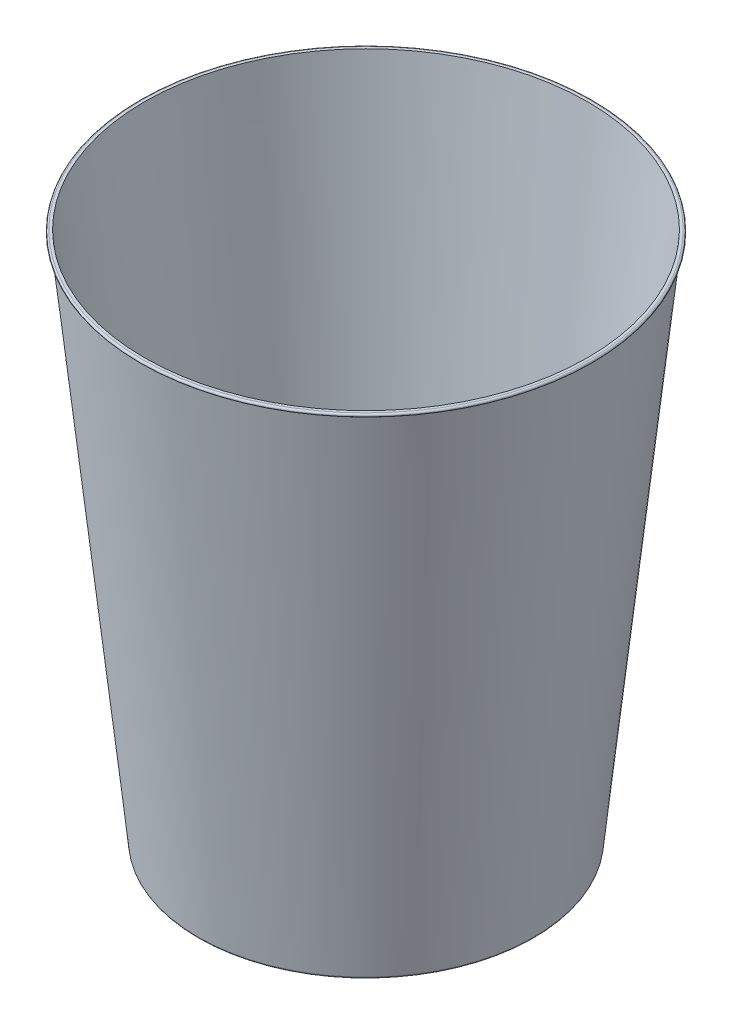
ISO-10303-21;
HEADER;
FILE_DESCRIPTION(('STEP AP214'),'2;1');
FILE_NAME('part.step','',(''),(''),'','','');
FILE_SCHEMA(('AUTOMOTIVE_DESIGN { 1 0 10303 214 1 1 1 1 }'));
ENDSEC;
DATA;
#1=APPLICATION_CONTEXT('core data for automotive mechanical design processes');
#2=APPLICATION_PROTOCOL_DEFINITION('international standard','automotive_design',2000,#1);
#3=PRODUCT_CONTEXT('',#1,'mechanical');
#4=PRODUCT('Part','Part','',(#3));
#5=PRODUCT_RELATED_PRODUCT_CATEGORY('part','',(#4));
#6=PRODUCT_DEFINITION_FORMATION('','',#4);
#7=PRODUCT_DEFINITION_CONTEXT('part definition',#1,'design');
#8=PRODUCT_DEFINITION('design','',#6,#7);
#9=PRODUCT_DEFINITION_SHAPE('','',#8);
#10=(LENGTH_UNIT() NAMED_UNIT(*) SI_UNIT(.MILLI.,.METRE.));
#11=(NAMED_UNIT(*) PLANE_ANGLE_UNIT() SI_UNIT($,.RADIAN.));
#12=(NAMED_UNIT(*) SI_UNIT($,.STERADIAN.) SOLID_ANGLE_UNIT());
#13=UNCERTAINTY_MEASURE_WITH_UNIT(LENGTH_MEASURE(1.E-05),#10,'distance_accuracy_value','');
#14=(GEOMETRIC_REPRESENTATION_CONTEXT(3) GLOBAL_UNCERTAINTY_ASSIGNED_CONTEXT((#13)) GLOBAL_UNIT_ASSIGNED_CONTEXT((#10,
#11,#12)) REPRESENTATION_CONTEXT('',''));
#15=CARTESIAN_POINT('',(0.,0.,0.));
#16=DIRECTION('',(0.,0.,1.));
#17=DIRECTION('',(1.,0.,0.));
#18=AXIS2_PLACEMENT_3D('',#15,#16,#17);
#19=CARTESIAN_POINT('',(0.,0.,0.));
#20=DIRECTION('',(0.,1.,0.));
#21=DIRECTION('',(0.,0.,1.));
#22=AXIS2_PLACEMENT_3D('',#19,#20,#21);
#23=CONICAL_SURFACE('',#22,35.,0.10471975511966);
#24=CARTESIAN_POINT('',(0.,-82.7313585389803,0.));
#25=DIRECTION('',(0.,1.,0.));
#26=DIRECTION('',(0.,0.,1.));
#27=AXIS2_PLACEMENT_3D('',#24,#25,#26);
#28=CIRCLE('',#27,26.30458382827);
#29=CARTESIAN_POINT('',(0.,-82.7313585389803,26.30458382827));
#30=VERTEX_POINT('',#29);
#31=EDGE_CURVE('E42',#30,#30,#28,.T.);
#32=ORIENTED_EDGE('',*,*,#31,.T.);
#33=EDGE_LOOP('',(#32));
#34=FACE_BOUND('',#33,.T.);
#35=CARTESIAN_POINT('',(0.,-0.329715107609698,0.));
#36=DIRECTION('',(0.,1.,0.));
#37=DIRECTION('',(0.,0.,1.));
#38=AXIS2_PLACEMENT_3D('',#35,#36,#37);
#39=CIRCLE('',#38,34.9653455457591);
#40=CARTESIAN_POINT('',(0.,-0.329715107609698,34.9653455457591));
#41=VERTEX_POINT('',#40);
#42=EDGE_CURVE('E46',#41,#41,#39,.F.);
#43=ORIENTED_EDGE('',*,*,#42,.T.);
#44=EDGE_LOOP('',(#43));
#45=FACE_BOUND('',#44,.T.);
#46=ADVANCED_FACE('F31',(#34,#45),#23,.T.);
#47=CARTESIAN_POINT('',(0.,-83.,0.));
#48=DIRECTION('',(0.,1.,0.));
#49=DIRECTION('',(0.,0.,1.));
#50=AXIS2_PLACEMENT_3D('',#47,#48,#49);
#51=PLANE('',#50);
#52=CARTESIAN_POINT('',(0.,-83.,0.));
#53=DIRECTION('',(0.,1.,0.));
#54=DIRECTION('',(0.,0.,1.));
#55=AXIS2_PLACEMENT_3D('',#52,#53,#54);
#56=CIRCLE('',#55,26.0062272596595);
#57=CARTESIAN_POINT('',(0.,-83.,26.0062272596595));
#58=VERTEX_POINT('',#57);
#59=EDGE_CURVE('E38',#58,#58,#56,.F.);
#60=ORIENTED_EDGE('',*,*,#59,.T.);
#61=EDGE_LOOP('',(#60));
#62=FACE_BOUND('',#61,.T.);
#63=ADVANCED_FACE('F89',(#62),#51,.F.);
#64=CARTESIAN_POINT('',(0.,-82.7,0.));
#65=DIRECTION('',(0.,1.,0.));
#66=DIRECTION('',(0.,0.,1.));
#67=AXIS2_PLACEMENT_3D('',#64,#65,#66);
#68=TOROIDAL_SURFACE('',#67,26.0062272596595,0.3);
#69=ORIENTED_EDGE('',*,*,#59,.F.);
#70=EDGE_LOOP('',(#69));
#71=FACE_BOUND('',#70,.T.);
#72=ORIENTED_EDGE('',*,*,#31,.F.);
#73=EDGE_LOOP('',(#72));
#74=FACE_BOUND('',#73,.T.);
#75=ADVANCED_FACE('F95',(#71,#74),#68,.T.);
#76=CARTESIAN_POINT('',(0.,-0.298356568629402,0.));
#77=DIRECTION('',(0.,1.,0.));
#78=DIRECTION('',(0.,0.,1.));
#79=AXIS2_PLACEMENT_3D('',#76,#77,#78);
#80=TOROIDAL_SURFACE('',#79,34.6669889771487,0.3);
#81=CARTESIAN_POINT('',(0.,-0.298356568629402,0.));
#82=DIRECTION('',(0.,-1.,0.));
#83=DIRECTION('',(0.,0.,-1.));
#84=AXIS2_PLACEMENT_3D('',#81,#82,#83);
#85=CIRCLE('',#84,34.9669889771487);
#86=CARTESIAN_POINT('',(0.,-0.298356568629402,-34.9669889771487));
#87=VERTEX_POINT('',#86);
#88=EDGE_CURVE('E10',#87,#87,#85,.F.);
#89=ORIENTED_EDGE('',*,*,#88,.F.);
#90=EDGE_LOOP('',(#89));
#91=FACE_BOUND('',#90,.T.);
#92=ORIENTED_EDGE('',*,*,#42,.F.);
#93=EDGE_LOOP('',(#92));
#94=FACE_BOUND('',#93,.T.);
#95=ADVANCED_FACE('F33',(#91,#94),#80,.T.);
#96=CARTESIAN_POINT('',(0.,-0.298356568629402,-35.0317707435081));
#97=DIRECTION('',(0.,-1.,0.));
#98=DIRECTION('',(0.,0.,-1.));
#99=AXIS2_PLACEMENT_3D('',#96,#97,#98);
#100=PLANE('',#99);
#101=CARTESIAN_POINT('',(0.,-0.298356568629403,0.));
#102=DIRECTION('',(0.,-1.,0.));
#103=DIRECTION('',(0.,0.,-1.));
#104=AXIS2_PLACEMENT_3D('',#101,#102,#103);
#105=CIRCLE('',#104,35.0317707435081);
#106=CARTESIAN_POINT('',(0.,-0.298356568629403,-35.0317707435081));
#107=VERTEX_POINT('',#106);
#108=EDGE_CURVE('E54',#107,#107,#105,.T.);
#109=ORIENTED_EDGE('',*,*,#108,.T.);
#110=EDGE_LOOP('',(#109));
#111=FACE_BOUND('',#110,.T.);
#112=ORIENTED_EDGE('',*,*,#88,.T.);
#113=EDGE_LOOP('',(#112));
#114=FACE_BOUND('',#113,.T.);
#115=ADVANCED_FACE('F103',(#111,#114),#100,.T.);
#116=CARTESIAN_POINT('',(0.,-0.348356568629402,0.));
#117=DIRECTION('',(0.,-1.,0.));
#118=DIRECTION('',(0.,0.,-1.));
#119=AXIS2_PLACEMENT_3D('',#116,#117,#118);
#120=TOROIDAL_SURFACE('',#119,35.0317707435081,0.0499999999999989);
#121=CARTESIAN_POINT('',(0.,-0.372046083356865,0.));
#122=DIRECTION('',(0.,-1.,0.));
#123=DIRECTION('',(0.,0.,-1.));
#124=AXIS2_PLACEMENT_3D('',#121,#122,#123);
#125=CIRCLE('',#124,35.075802628455);
#126=CARTESIAN_POINT('',(0.,-0.372046083356865,-35.075802628455));
#127=VERTEX_POINT('',#126);
#128=EDGE_CURVE('E57',#127,#127,#125,.T.);
#129=ORIENTED_EDGE('',*,*,#128,.T.);
#130=EDGE_LOOP('',(#129));
#131=FACE_BOUND('',#130,.T.);
#132=ORIENTED_EDGE('',*,*,#108,.F.);
#133=EDGE_LOOP('',(#132));
#134=FACE_BOUND('',#133,.T.);
#135=ADVANCED_FACE('F110',(#131,#134),#120,.F.);
#136=CARTESIAN_POINT('',(0.,-0.372046083356865,0.));
#137=DIRECTION('',(0.,1.,0.));
#138=DIRECTION('',(0.,0.,1.));
#139=AXIS2_PLACEMENT_3D('',#136,#137,#138);
#140=CONICAL_SURFACE('',#139,35.075802628455,0.493589853462029);
#141=CARTESIAN_POINT('',(0.,-0.419390976745577,0.));
#142=DIRECTION('',(0.,-1.,0.));
#143=DIRECTION('',(0.,0.,-1.));
#144=AXIS2_PLACEMENT_3D('',#141,#142,#143);
#145=CIRCLE('',#144,35.0503306880519);
#146=CARTESIAN_POINT('',(0.,-0.419390976745577,-35.0503306880519));
#147=VERTEX_POINT('',#146);
#148=EDGE_CURVE('E60',#147,#147,#145,.T.);
#149=ORIENTED_EDGE('',*,*,#148,.T.);
#150=EDGE_LOOP('',(#149));
#151=FACE_BOUND('',#150,.T.);
#152=ORIENTED_EDGE('',*,*,#128,.F.);
#153=EDGE_LOOP('',(#152));
#154=FACE_BOUND('',#153,.T.);
#155=ADVANCED_FACE('F117',(#151,#154),#140,.F.);
#156=CARTESIAN_POINT('',(0.,-0.44308049147304,0.));
#157=DIRECTION('',(0.,-1.,0.));
#158=DIRECTION('',(0.,0.,-1.));
#159=AXIS2_PLACEMENT_3D('',#156,#157,#158);
#160=TOROIDAL_SURFACE('',#159,35.0943625729988,0.0499999999999984);
#161=CARTESIAN_POINT('',(0.,-0.491636681408076,0.));
#162=DIRECTION('',(0.,-1.,0.));
#163=DIRECTION('',(0.,0.,-1.));
#164=AXIS2_PLACEMENT_3D('',#161,#162,#163);
#165=CIRCLE('',#164,35.0824337667303);
#166=CARTESIAN_POINT('',(0.,-0.491636681408076,-35.0824337667303));
#167=VERTEX_POINT('',#166);
#168=EDGE_CURVE('E63',#167,#167,#165,.T.);
#169=ORIENTED_EDGE('',*,*,#168,.T.);
#170=EDGE_LOOP('',(#169));
#171=FACE_BOUND('',#170,.T.);
#172=ORIENTED_EDGE('',*,*,#148,.F.);
#173=EDGE_LOOP('',(#172));
#174=FACE_BOUND('',#173,.T.);
#175=ADVANCED_FACE('F123',(#171,#174),#160,.T.);
#176=CARTESIAN_POINT('',(0.,-0.248863423165296,0.));
#177=DIRECTION('',(0.,-1.,0.));
#178=DIRECTION('',(0.,0.,-1.));
#179=AXIS2_PLACEMENT_3D('',#176,#177,#178);
#180=TOROIDAL_SURFACE('',#179,35.1420759085177,0.249992079864162);
#181=CARTESIAN_POINT('',(0.,0.,0.));
#182=DIRECTION('',(0.,-1.,0.));
#183=DIRECTION('',(0.,0.,-1.));
#184=AXIS2_PLACEMENT_3D('',#181,#182,#183);
#185=CIRCLE('',#184,35.118347516131);
#186=CARTESIAN_POINT('',(0.,0.,-35.118347516131));
#187=VERTEX_POINT('',#186);
#188=EDGE_CURVE('E66',#187,#187,#185,.T.);
#189=ORIENTED_EDGE('',*,*,#188,.T.);
#190=EDGE_LOOP('',(#189));
#191=FACE_BOUND('',#190,.T.);
#192=ORIENTED_EDGE('',*,*,#168,.F.);
#193=EDGE_LOOP('',(#192));
#194=FACE_BOUND('',#193,.T.);
#195=ADVANCED_FACE('F127',(#191,#194),#180,.T.);
#196=CARTESIAN_POINT('',(0.,0.,-34.698347516131));
#197=DIRECTION('',(0.,1.,0.));
#198=DIRECTION('',(0.,0.,1.));
#199=AXIS2_PLACEMENT_3D('',#196,#197,#198);
#200=PLANE('',#199);
#201=CARTESIAN_POINT('',(0.,0.,0.));
#202=DIRECTION('',(0.,-1.,0.));
#203=DIRECTION('',(0.,0.,-1.));
#204=AXIS2_PLACEMENT_3D('',#201,#202,#203);
#205=CIRCLE('',#204,34.698347516131);
#206=CARTESIAN_POINT('',(0.,0.,-34.698347516131));
#207=VERTEX_POINT('',#206);
#208=EDGE_CURVE('E69',#207,#207,#205,.T.);
#209=ORIENTED_EDGE('',*,*,#208,.T.);
#210=EDGE_LOOP('',(#209));
#211=FACE_BOUND('',#210,.T.);
#212=ORIENTED_EDGE('',*,*,#188,.F.);
#213=EDGE_LOOP('',(#212));
#214=FACE_BOUND('',#213,.T.);
#215=ADVANCED_FACE('F73',(#211,#214),#200,.T.);
#216=CARTESIAN_POINT('',(0.,-82.7,0.));
#217=DIRECTION('',(0.,1.,0.));
#218=DIRECTION('',(0.,0.,1.));
#219=AXIS2_PLACEMENT_3D('',#216,#217,#218);
#220=PLANE('',#219);
#221=CARTESIAN_POINT('',(0.,-82.7,0.));
#222=DIRECTION('',(0.,1.,0.));
#223=DIRECTION('',(0.,0.,1.));
#224=AXIS2_PLACEMENT_3D('',#221,#222,#223);
#225=CIRCLE('',#224,26.0062272596595);
#226=CARTESIAN_POINT('',(0.,-82.7,26.0062272596595));
#227=VERTEX_POINT('',#226);
#228=EDGE_CURVE('E51',#227,#227,#225,.T.);
#229=ORIENTED_EDGE('',*,*,#228,.T.);
#230=EDGE_LOOP('',(#229));
#231=FACE_BOUND('',#230,.T.);
#232=ADVANCED_FACE('F78',(#231),#220,.T.);
#233=CARTESIAN_POINT('',(0.,0.0313585389802961,0.));
#234=DIRECTION('',(0.,1.,0.));
#235=DIRECTION('',(0.,0.,1.));
#236=AXIS2_PLACEMENT_3D('',#233,#234,#235);
#237=CONICAL_SURFACE('',#236,34.7016434313895,0.10471975511966);
#238=ORIENTED_EDGE('',*,*,#228,.F.);
#239=EDGE_LOOP('',(#238));
#240=FACE_BOUND('',#239,.T.);
#241=ORIENTED_EDGE('',*,*,#208,.F.);
#242=EDGE_LOOP('',(#241));
#243=FACE_BOUND('',#242,.T.);
#244=ADVANCED_FACE('F76',(#240,#243),#237,.F.);
#245=CLOSED_SHELL('',(#46,#63,#75,#95,#115,#135,#155,#175,#195,#215,#232,#244));
#246=MANIFOLD_SOLID_BREP('B2',#245);
#247=ADVANCED_BREP_SHAPE_REPRESENTATION('',(#18,#246),#14);
#248=SHAPE_DEFINITION_REPRESENTATION(#9,#247);
ENDSEC;
END-ISO-10303-21;
